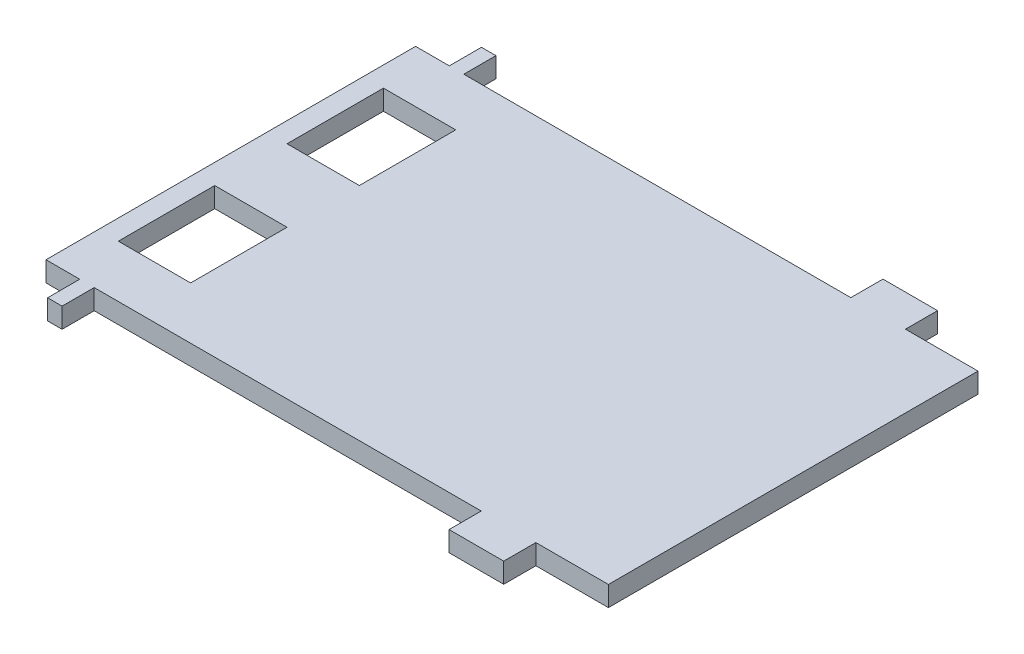
ISO-10303-21;
HEADER;
FILE_DESCRIPTION(('STEP AP214'),'2;1');
FILE_NAME('part.step','',(''),(''),'','','');
FILE_SCHEMA(('AUTOMOTIVE_DESIGN { 1 0 10303 214 1 1 1 1 }'));
ENDSEC;
DATA;
#1=APPLICATION_CONTEXT('core data for automotive mechanical design processes');
#2=APPLICATION_PROTOCOL_DEFINITION('international standard','automotive_design',2000,#1);
#3=PRODUCT_CONTEXT('',#1,'mechanical');
#4=PRODUCT('Part','Part','',(#3));
#5=PRODUCT_RELATED_PRODUCT_CATEGORY('part','',(#4));
#6=PRODUCT_DEFINITION_FORMATION('','',#4);
#7=PRODUCT_DEFINITION_CONTEXT('part definition',#1,'design');
#8=PRODUCT_DEFINITION('design','',#6,#7);
#9=PRODUCT_DEFINITION_SHAPE('','',#8);
#10=(LENGTH_UNIT() NAMED_UNIT(*) SI_UNIT(.MILLI.,.METRE.));
#11=(NAMED_UNIT(*) PLANE_ANGLE_UNIT() SI_UNIT($,.RADIAN.));
#12=(NAMED_UNIT(*) SI_UNIT($,.STERADIAN.) SOLID_ANGLE_UNIT());
#13=UNCERTAINTY_MEASURE_WITH_UNIT(LENGTH_MEASURE(1.E-05),#10,'distance_accuracy_value','');
#14=(GEOMETRIC_REPRESENTATION_CONTEXT(3) GLOBAL_UNCERTAINTY_ASSIGNED_CONTEXT((#13)) GLOBAL_UNIT_ASSIGNED_CONTEXT((#10,
#11,#12)) REPRESENTATION_CONTEXT('',''));
#15=CARTESIAN_POINT('',(0.,0.,0.));
#16=DIRECTION('',(0.,0.,1.));
#17=DIRECTION('',(1.,0.,0.));
#18=AXIS2_PLACEMENT_3D('',#15,#16,#17);
#19=CARTESIAN_POINT('',(-35.,2.5,27.));
#20=DIRECTION('',(0.,0.,-1.));
#21=DIRECTION('',(-1.,0.,0.));
#22=AXIS2_PLACEMENT_3D('',#19,#20,#21);
#23=PLANE('',#22);
#24=DIRECTION('',(1.,0.,0.));
#25=VECTOR('',#24,1.);
#26=CARTESIAN_POINT('',(-35.,0.,27.));
#27=LINE('',#26,#25);
#28=CARTESIAN_POINT('',(-30.8,0.,27.));
#29=VERTEX_POINT('',#28);
#30=CARTESIAN_POINT('',(-29.,0.,27.));
#31=VERTEX_POINT('',#30);
#32=EDGE_CURVE('E37',#29,#31,#27,.T.);
#33=ORIENTED_EDGE('',*,*,#32,.T.);
#34=DIRECTION('',(0.,1.,0.));
#35=VECTOR('',#34,1.);
#36=CARTESIAN_POINT('',(-29.,0.,27.));
#37=LINE('',#36,#35);
#38=CARTESIAN_POINT('',(-29.,2.5,27.));
#39=VERTEX_POINT('',#38);
#40=EDGE_CURVE('E306',#31,#39,#37,.T.);
#41=ORIENTED_EDGE('',*,*,#40,.T.);
#42=DIRECTION('',(1.,0.,0.));
#43=VECTOR('',#42,1.);
#44=CARTESIAN_POINT('',(-35.,2.5,27.));
#45=LINE('',#44,#43);
#46=CARTESIAN_POINT('',(-30.8,2.5,27.));
#47=VERTEX_POINT('',#46);
#48=EDGE_CURVE('E11',#47,#39,#45,.T.);
#49=ORIENTED_EDGE('',*,*,#48,.F.);
#50=DIRECTION('',(0.,1.,0.));
#51=VECTOR('',#50,1.);
#52=CARTESIAN_POINT('',(-30.8,0.,27.));
#53=LINE('',#52,#51);
#54=EDGE_CURVE('E348',#29,#47,#53,.T.);
#55=ORIENTED_EDGE('',*,*,#54,.F.);
#56=EDGE_LOOP('',(#33,#41,#49,#55));
#57=FACE_BOUND('',#56,.T.);
#58=ADVANCED_FACE('F33',(#57),#23,.F.);
#59=CARTESIAN_POINT('',(-35.,2.5,-27.));
#60=DIRECTION('',(0.,0.,1.));
#61=DIRECTION('',(1.,0.,0.));
#62=AXIS2_PLACEMENT_3D('',#59,#60,#61);
#63=PLANE('',#62);
#64=DIRECTION('',(-1.,0.,0.));
#65=VECTOR('',#64,1.);
#66=CARTESIAN_POINT('',(-35.,0.,-27.));
#67=LINE('',#66,#65);
#68=CARTESIAN_POINT('',(25.97,0.,-27.));
#69=VERTEX_POINT('',#68);
#70=CARTESIAN_POINT('',(19.17,0.,-27.));
#71=VERTEX_POINT('',#70);
#72=EDGE_CURVE('E426',#69,#71,#67,.T.);
#73=ORIENTED_EDGE('',*,*,#72,.T.);
#74=DIRECTION('',(0.,1.,0.));
#75=VECTOR('',#74,1.);
#76=CARTESIAN_POINT('',(19.17,0.,-27.));
#77=LINE('',#76,#75);
#78=CARTESIAN_POINT('',(19.17,2.5,-27.));
#79=VERTEX_POINT('',#78);
#80=EDGE_CURVE('E387',#71,#79,#77,.T.);
#81=ORIENTED_EDGE('',*,*,#80,.T.);
#82=DIRECTION('',(-1.,0.,0.));
#83=VECTOR('',#82,1.);
#84=CARTESIAN_POINT('',(-35.,2.5,-27.));
#85=LINE('',#84,#83);
#86=CARTESIAN_POINT('',(25.97,2.5,-27.));
#87=VERTEX_POINT('',#86);
#88=EDGE_CURVE('E418',#87,#79,#85,.T.);
#89=ORIENTED_EDGE('',*,*,#88,.F.);
#90=DIRECTION('',(0.,1.,0.));
#91=VECTOR('',#90,1.);
#92=CARTESIAN_POINT('',(25.97,0.,-27.));
#93=LINE('',#92,#91);
#94=EDGE_CURVE('E403',#69,#87,#93,.T.);
#95=ORIENTED_EDGE('',*,*,#94,.F.);
#96=EDGE_LOOP('',(#73,#81,#89,#95));
#97=FACE_BOUND('',#96,.T.);
#98=ADVANCED_FACE('F489',(#97),#63,.F.);
#99=CARTESIAN_POINT('',(35.,2.5,-27.));
#100=DIRECTION('',(-1.,0.,0.));
#101=DIRECTION('',(0.,0.,1.));
#102=AXIS2_PLACEMENT_3D('',#99,#100,#101);
#103=PLANE('',#102);
#104=DIRECTION('',(0.,0.,-1.));
#105=VECTOR('',#104,1.);
#106=CARTESIAN_POINT('',(35.,2.5,-27.));
#107=LINE('',#106,#105);
#108=CARTESIAN_POINT('',(35.,2.5,23.));
#109=VERTEX_POINT('',#108);
#110=CARTESIAN_POINT('',(35.,2.5,-23.));
#111=VERTEX_POINT('',#110);
#112=EDGE_CURVE('E415',#109,#111,#107,.T.);
#113=ORIENTED_EDGE('',*,*,#112,.F.);
#114=DIRECTION('',(0.,1.,0.));
#115=VECTOR('',#114,1.);
#116=CARTESIAN_POINT('',(35.,0.,23.));
#117=LINE('',#116,#115);
#118=CARTESIAN_POINT('',(35.,0.,23.));
#119=VERTEX_POINT('',#118);
#120=EDGE_CURVE('E330',#119,#109,#117,.T.);
#121=ORIENTED_EDGE('',*,*,#120,.F.);
#122=DIRECTION('',(0.,0.,-1.));
#123=VECTOR('',#122,1.);
#124=CARTESIAN_POINT('',(35.,0.,-27.));
#125=LINE('',#124,#123);
#126=CARTESIAN_POINT('',(35.,0.,-23.));
#127=VERTEX_POINT('',#126);
#128=EDGE_CURVE('E411',#119,#127,#125,.T.);
#129=ORIENTED_EDGE('',*,*,#128,.T.);
#130=DIRECTION('',(0.,1.,0.));
#131=VECTOR('',#130,1.);
#132=CARTESIAN_POINT('',(35.,0.,-23.));
#133=LINE('',#132,#131);
#134=EDGE_CURVE('E408',#127,#111,#133,.T.);
#135=ORIENTED_EDGE('',*,*,#134,.T.);
#136=EDGE_LOOP('',(#113,#121,#129,#135));
#137=FACE_BOUND('',#136,.T.);
#138=ADVANCED_FACE('F35',(#137),#103,.F.);
#139=CARTESIAN_POINT('',(-29.,0.,-27.));
#140=VERTEX_POINT('',#139);
#141=CARTESIAN_POINT('',(-30.8,0.,-27.));
#142=VERTEX_POINT('',#141);
#143=EDGE_CURVE('E425',#140,#142,#67,.T.);
#144=ORIENTED_EDGE('',*,*,#143,.T.);
#145=DIRECTION('',(0.,1.,0.));
#146=VECTOR('',#145,1.);
#147=CARTESIAN_POINT('',(-30.8,0.,-27.));
#148=LINE('',#147,#146);
#149=CARTESIAN_POINT('',(-30.8,2.5,-27.));
#150=VERTEX_POINT('',#149);
#151=EDGE_CURVE('E363',#142,#150,#148,.T.);
#152=ORIENTED_EDGE('',*,*,#151,.T.);
#153=CARTESIAN_POINT('',(-29.,2.5,-27.));
#154=VERTEX_POINT('',#153);
#155=EDGE_CURVE('E417',#154,#150,#85,.T.);
#156=ORIENTED_EDGE('',*,*,#155,.F.);
#157=DIRECTION('',(0.,1.,0.));
#158=VECTOR('',#157,1.);
#159=CARTESIAN_POINT('',(-29.,0.,-27.));
#160=LINE('',#159,#158);
#161=EDGE_CURVE('E380',#140,#154,#160,.T.);
#162=ORIENTED_EDGE('',*,*,#161,.F.);
#163=EDGE_LOOP('',(#144,#152,#156,#162));
#164=FACE_BOUND('',#163,.T.);
#165=ADVANCED_FACE('F474',(#164),#63,.F.);
#166=CARTESIAN_POINT('',(-35.,2.5,-27.));
#167=DIRECTION('',(1.,0.,0.));
#168=DIRECTION('',(0.,0.,-1.));
#169=AXIS2_PLACEMENT_3D('',#166,#167,#168);
#170=PLANE('',#169);
#171=DIRECTION('',(0.,0.,1.));
#172=VECTOR('',#171,1.);
#173=CARTESIAN_POINT('',(-35.,0.,-27.));
#174=LINE('',#173,#172);
#175=CARTESIAN_POINT('',(-35.,0.,-23.));
#176=VERTEX_POINT('',#175);
#177=CARTESIAN_POINT('',(-35.,0.,23.));
#178=VERTEX_POINT('',#177);
#179=EDGE_CURVE('E428',#176,#178,#174,.T.);
#180=ORIENTED_EDGE('',*,*,#179,.T.);
#181=DIRECTION('',(0.,1.,0.));
#182=VECTOR('',#181,1.);
#183=CARTESIAN_POINT('',(-35.,0.,23.));
#184=LINE('',#183,#182);
#185=CARTESIAN_POINT('',(-35.,2.5,23.));
#186=VERTEX_POINT('',#185);
#187=EDGE_CURVE('E341',#178,#186,#184,.T.);
#188=ORIENTED_EDGE('',*,*,#187,.T.);
#189=DIRECTION('',(0.,0.,1.));
#190=VECTOR('',#189,1.);
#191=CARTESIAN_POINT('',(-35.,2.5,-27.));
#192=LINE('',#191,#190);
#193=CARTESIAN_POINT('',(-35.,2.5,-23.));
#194=VERTEX_POINT('',#193);
#195=EDGE_CURVE('E421',#194,#186,#192,.T.);
#196=ORIENTED_EDGE('',*,*,#195,.F.);
#197=DIRECTION('',(0.,1.,0.));
#198=VECTOR('',#197,1.);
#199=CARTESIAN_POINT('',(-35.,0.,-23.));
#200=LINE('',#199,#198);
#201=EDGE_CURVE('E359',#176,#194,#200,.T.);
#202=ORIENTED_EDGE('',*,*,#201,.F.);
#203=EDGE_LOOP('',(#180,#188,#196,#202));
#204=FACE_BOUND('',#203,.T.);
#205=ADVANCED_FACE('F466',(#204),#170,.F.);
#206=CARTESIAN_POINT('',(19.17,2.5,27.));
#207=VERTEX_POINT('',#206);
#208=CARTESIAN_POINT('',(25.97,2.5,27.));
#209=VERTEX_POINT('',#208);
#210=EDGE_CURVE('E42',#207,#209,#45,.T.);
#211=ORIENTED_EDGE('',*,*,#210,.F.);
#212=DIRECTION('',(0.,1.,0.));
#213=VECTOR('',#212,1.);
#214=CARTESIAN_POINT('',(19.17,0.,27.));
#215=LINE('',#214,#213);
#216=CARTESIAN_POINT('',(19.17,0.,27.));
#217=VERTEX_POINT('',#216);
#218=EDGE_CURVE('E299',#217,#207,#215,.T.);
#219=ORIENTED_EDGE('',*,*,#218,.F.);
#220=CARTESIAN_POINT('',(25.97,0.,27.));
#221=VERTEX_POINT('',#220);
#222=EDGE_CURVE('E430',#217,#221,#27,.T.);
#223=ORIENTED_EDGE('',*,*,#222,.T.);
#224=DIRECTION('',(0.,1.,0.));
#225=VECTOR('',#224,1.);
#226=CARTESIAN_POINT('',(25.97,0.,27.));
#227=LINE('',#226,#225);
#228=EDGE_CURVE('E322',#221,#209,#227,.T.);
#229=ORIENTED_EDGE('',*,*,#228,.T.);
#230=EDGE_LOOP('',(#211,#219,#223,#229));
#231=FACE_BOUND('',#230,.T.);
#232=ADVANCED_FACE('F511',(#231),#23,.F.);
#233=CARTESIAN_POINT('',(0.,2.5,0.));
#234=DIRECTION('',(0.,1.,0.));
#235=DIRECTION('',(0.,0.,1.));
#236=AXIS2_PLACEMENT_3D('',#233,#234,#235);
#237=PLANE('',#236);
#238=DIRECTION('',(1.,0.,0.));
#239=VECTOR('',#238,1.);
#240=CARTESIAN_POINT('',(-32.5,2.5,16.5));
#241=LINE('',#240,#239);
#242=CARTESIAN_POINT('',(-32.5,2.5,16.5));
#243=VERTEX_POINT('',#242);
#244=CARTESIAN_POINT('',(-23.5,2.5,16.5));
#245=VERTEX_POINT('',#244);
#246=EDGE_CURVE('E50',#243,#245,#241,.T.);
#247=ORIENTED_EDGE('',*,*,#246,.F.);
#248=DIRECTION('',(0.,0.,1.));
#249=VECTOR('',#248,1.);
#250=CARTESIAN_POINT('',(-32.5,2.5,16.5));
#251=LINE('',#250,#249);
#252=CARTESIAN_POINT('',(-32.5,2.5,4.49999999999999));
#253=VERTEX_POINT('',#252);
#254=EDGE_CURVE('E238',#253,#243,#251,.T.);
#255=ORIENTED_EDGE('',*,*,#254,.F.);
#256=DIRECTION('',(-1.,0.,0.));
#257=VECTOR('',#256,1.);
#258=CARTESIAN_POINT('',(-32.5,2.5,4.49999999999999));
#259=LINE('',#258,#257);
#260=CARTESIAN_POINT('',(-23.5,2.5,4.49999999999999));
#261=VERTEX_POINT('',#260);
#262=EDGE_CURVE('E241',#261,#253,#259,.T.);
#263=ORIENTED_EDGE('',*,*,#262,.F.);
#264=DIRECTION('',(0.,0.,-1.));
#265=VECTOR('',#264,1.);
#266=CARTESIAN_POINT('',(-23.5,2.5,16.5));
#267=LINE('',#266,#265);
#268=EDGE_CURVE('E247',#245,#261,#267,.T.);
#269=ORIENTED_EDGE('',*,*,#268,.F.);
#270=EDGE_LOOP('',(#247,#255,#263,#269));
#271=FACE_BOUND('',#270,.T.);
#272=DIRECTION('',(0.,0.,-1.));
#273=VECTOR('',#272,1.);
#274=CARTESIAN_POINT('',(-23.5,2.5,-16.5));
#275=LINE('',#274,#273);
#276=CARTESIAN_POINT('',(-23.5,2.5,-4.49999999999999));
#277=VERTEX_POINT('',#276);
#278=CARTESIAN_POINT('',(-23.5,2.5,-16.5));
#279=VERTEX_POINT('',#278);
#280=EDGE_CURVE('E253',#277,#279,#275,.T.);
#281=ORIENTED_EDGE('',*,*,#280,.F.);
#282=DIRECTION('',(1.,0.,0.));
#283=VECTOR('',#282,1.);
#284=CARTESIAN_POINT('',(-32.5,2.5,-4.49999999999999));
#285=LINE('',#284,#283);
#286=CARTESIAN_POINT('',(-32.5,2.5,-4.49999999999999));
#287=VERTEX_POINT('',#286);
#288=EDGE_CURVE('E261',#287,#277,#285,.T.);
#289=ORIENTED_EDGE('',*,*,#288,.F.);
#290=DIRECTION('',(0.,0.,1.));
#291=VECTOR('',#290,1.);
#292=CARTESIAN_POINT('',(-32.5,2.5,-16.5));
#293=LINE('',#292,#291);
#294=CARTESIAN_POINT('',(-32.5,2.5,-16.5));
#295=VERTEX_POINT('',#294);
#296=EDGE_CURVE('E275',#295,#287,#293,.T.);
#297=ORIENTED_EDGE('',*,*,#296,.F.);
#298=DIRECTION('',(-1.,0.,0.));
#299=VECTOR('',#298,1.);
#300=CARTESIAN_POINT('',(-32.5,2.5,-16.5));
#301=LINE('',#300,#299);
#302=EDGE_CURVE('E272',#279,#295,#301,.T.);
#303=ORIENTED_EDGE('',*,*,#302,.F.);
#304=EDGE_LOOP('',(#281,#289,#297,#303));
#305=FACE_BOUND('',#304,.T.);
#306=DIRECTION('',(0.,0.,1.));
#307=VECTOR('',#306,1.);
#308=CARTESIAN_POINT('',(-29.,2.5,23.));
#309=LINE('',#308,#307);
#310=CARTESIAN_POINT('',(-29.,2.5,23.));
#311=VERTEX_POINT('',#310);
#312=EDGE_CURVE('E293',#311,#39,#309,.T.);
#313=ORIENTED_EDGE('',*,*,#312,.F.);
#314=DIRECTION('',(-1.,0.,0.));
#315=VECTOR('',#314,1.);
#316=CARTESIAN_POINT('',(19.17,2.5,23.));
#317=LINE('',#316,#315);
#318=CARTESIAN_POINT('',(19.17,2.5,23.));
#319=VERTEX_POINT('',#318);
#320=EDGE_CURVE('E302',#319,#311,#317,.T.);
#321=ORIENTED_EDGE('',*,*,#320,.F.);
#322=DIRECTION('',(0.,0.,-1.));
#323=VECTOR('',#322,1.);
#324=CARTESIAN_POINT('',(19.17,2.5,27.));
#325=LINE('',#324,#323);
#326=EDGE_CURVE('E282',#207,#319,#325,.T.);
#327=ORIENTED_EDGE('',*,*,#326,.F.);
#328=ORIENTED_EDGE('',*,*,#210,.T.);
#329=DIRECTION('',(0.,0.,1.));
#330=VECTOR('',#329,1.);
#331=CARTESIAN_POINT('',(25.97,2.5,27.));
#332=LINE('',#331,#330);
#333=CARTESIAN_POINT('',(25.97,2.5,23.));
#334=VERTEX_POINT('',#333);
#335=EDGE_CURVE('E309',#334,#209,#332,.T.);
#336=ORIENTED_EDGE('',*,*,#335,.F.);
#337=DIRECTION('',(-1.,0.,0.));
#338=VECTOR('',#337,1.);
#339=CARTESIAN_POINT('',(25.97,2.5,23.));
#340=LINE('',#339,#338);
#341=EDGE_CURVE('E319',#109,#334,#340,.T.);
#342=ORIENTED_EDGE('',*,*,#341,.F.);
#343=ORIENTED_EDGE('',*,*,#112,.T.);
#344=DIRECTION('',(1.,0.,0.));
#345=VECTOR('',#344,1.);
#346=CARTESIAN_POINT('',(25.97,2.5,-23.));
#347=LINE('',#346,#345);
#348=CARTESIAN_POINT('',(25.97,2.5,-23.));
#349=VERTEX_POINT('',#348);
#350=EDGE_CURVE('E400',#349,#111,#347,.T.);
#351=ORIENTED_EDGE('',*,*,#350,.F.);
#352=DIRECTION('',(0.,0.,1.));
#353=VECTOR('',#352,1.);
#354=CARTESIAN_POINT('',(25.97,2.5,-27.));
#355=LINE('',#354,#353);
#356=EDGE_CURVE('E390',#87,#349,#355,.T.);
#357=ORIENTED_EDGE('',*,*,#356,.F.);
#358=ORIENTED_EDGE('',*,*,#88,.T.);
#359=DIRECTION('',(0.,0.,-1.));
#360=VECTOR('',#359,1.);
#361=CARTESIAN_POINT('',(19.17,2.5,-27.));
#362=LINE('',#361,#360);
#363=CARTESIAN_POINT('',(19.17,2.5,-23.));
#364=VERTEX_POINT('',#363);
#365=EDGE_CURVE('E374',#364,#79,#362,.T.);
#366=ORIENTED_EDGE('',*,*,#365,.F.);
#367=DIRECTION('',(1.,0.,0.));
#368=VECTOR('',#367,1.);
#369=CARTESIAN_POINT('',(19.17,2.5,-23.));
#370=LINE('',#369,#368);
#371=CARTESIAN_POINT('',(-29.,2.5,-23.));
#372=VERTEX_POINT('',#371);
#373=EDGE_CURVE('E383',#372,#364,#370,.T.);
#374=ORIENTED_EDGE('',*,*,#373,.F.);
#375=DIRECTION('',(0.,0.,1.));
#376=VECTOR('',#375,1.);
#377=CARTESIAN_POINT('',(-29.,2.5,-23.));
#378=LINE('',#377,#376);
#379=EDGE_CURVE('E366',#154,#372,#378,.T.);
#380=ORIENTED_EDGE('',*,*,#379,.F.);
#381=ORIENTED_EDGE('',*,*,#155,.T.);
#382=DIRECTION('',(0.,0.,-1.));
#383=VECTOR('',#382,1.);
#384=CARTESIAN_POINT('',(-30.8,2.5,-27.));
#385=LINE('',#384,#383);
#386=CARTESIAN_POINT('',(-30.8,2.5,-23.));
#387=VERTEX_POINT('',#386);
#388=EDGE_CURVE('E356',#387,#150,#385,.T.);
#389=ORIENTED_EDGE('',*,*,#388,.F.);
#390=DIRECTION('',(1.,0.,0.));
#391=VECTOR('',#390,1.);
#392=CARTESIAN_POINT('',(-30.8,2.5,-23.));
#393=LINE('',#392,#391);
#394=EDGE_CURVE('E347',#194,#387,#393,.T.);
#395=ORIENTED_EDGE('',*,*,#394,.F.);
#396=ORIENTED_EDGE('',*,*,#195,.T.);
#397=DIRECTION('',(-1.,0.,0.));
#398=VECTOR('',#397,1.);
#399=CARTESIAN_POINT('',(-30.8,2.5,23.));
#400=LINE('',#399,#398);
#401=CARTESIAN_POINT('',(-30.8,2.5,23.));
#402=VERTEX_POINT('',#401);
#403=EDGE_CURVE('E329',#402,#186,#400,.T.);
#404=ORIENTED_EDGE('',*,*,#403,.F.);
#405=DIRECTION('',(0.,0.,-1.));
#406=VECTOR('',#405,1.);
#407=CARTESIAN_POINT('',(-30.8,2.5,27.));
#408=LINE('',#407,#406);
#409=EDGE_CURVE('E338',#47,#402,#408,.T.);
#410=ORIENTED_EDGE('',*,*,#409,.F.);
#411=ORIENTED_EDGE('',*,*,#48,.T.);
#412=EDGE_LOOP('',(#313,#321,#327,#328,#336,#342,#343,#351,#357,#358,#366,#374,#380,#381,#389,
#395,#396,#404,#410,#411));
#413=FACE_BOUND('',#412,.T.);
#414=ADVANCED_FACE('F450',(#271,#305,#413),#237,.T.);
#415=CARTESIAN_POINT('',(0.,0.,0.));
#416=DIRECTION('',(0.,1.,0.));
#417=DIRECTION('',(0.,0.,1.));
#418=AXIS2_PLACEMENT_3D('',#415,#416,#417);
#419=PLANE('',#418);
#420=DIRECTION('',(0.,0.,1.));
#421=VECTOR('',#420,1.);
#422=CARTESIAN_POINT('',(-32.5,0.,16.5));
#423=LINE('',#422,#421);
#424=CARTESIAN_POINT('',(-32.5,0.,4.49999999999999));
#425=VERTEX_POINT('',#424);
#426=CARTESIAN_POINT('',(-32.5,0.,16.5));
#427=VERTEX_POINT('',#426);
#428=EDGE_CURVE('E228',#425,#427,#423,.T.);
#429=ORIENTED_EDGE('',*,*,#428,.T.);
#430=DIRECTION('',(1.,0.,0.));
#431=VECTOR('',#430,1.);
#432=CARTESIAN_POINT('',(-32.5,0.,16.5));
#433=LINE('',#432,#431);
#434=CARTESIAN_POINT('',(-23.5,0.,16.5));
#435=VERTEX_POINT('',#434);
#436=EDGE_CURVE('E222',#427,#435,#433,.T.);
#437=ORIENTED_EDGE('',*,*,#436,.T.);
#438=DIRECTION('',(0.,0.,-1.));
#439=VECTOR('',#438,1.);
#440=CARTESIAN_POINT('',(-23.5,0.,16.5));
#441=LINE('',#440,#439);
#442=CARTESIAN_POINT('',(-23.5,0.,4.49999999999999));
#443=VERTEX_POINT('',#442);
#444=EDGE_CURVE('E231',#435,#443,#441,.T.);
#445=ORIENTED_EDGE('',*,*,#444,.T.);
#446=DIRECTION('',(-1.,0.,0.));
#447=VECTOR('',#446,1.);
#448=CARTESIAN_POINT('',(-32.5,0.,4.49999999999999));
#449=LINE('',#448,#447);
#450=EDGE_CURVE('E58',#443,#425,#449,.T.);
#451=ORIENTED_EDGE('',*,*,#450,.T.);
#452=EDGE_LOOP('',(#429,#437,#445,#451));
#453=FACE_BOUND('',#452,.T.);
#454=DIRECTION('',(1.,0.,0.));
#455=VECTOR('',#454,1.);
#456=CARTESIAN_POINT('',(-32.5,0.,-4.49999999999999));
#457=LINE('',#456,#455);
#458=CARTESIAN_POINT('',(-32.5,0.,-4.49999999999999));
#459=VERTEX_POINT('',#458);
#460=CARTESIAN_POINT('',(-23.5,0.,-4.49999999999999));
#461=VERTEX_POINT('',#460);
#462=EDGE_CURVE('E267',#459,#461,#457,.T.);
#463=ORIENTED_EDGE('',*,*,#462,.T.);
#464=DIRECTION('',(0.,0.,-1.));
#465=VECTOR('',#464,1.);
#466=CARTESIAN_POINT('',(-23.5,0.,-16.5));
#467=LINE('',#466,#465);
#468=CARTESIAN_POINT('',(-23.5,0.,-16.5));
#469=VERTEX_POINT('',#468);
#470=EDGE_CURVE('E257',#461,#469,#467,.T.);
#471=ORIENTED_EDGE('',*,*,#470,.T.);
#472=DIRECTION('',(-1.,0.,0.));
#473=VECTOR('',#472,1.);
#474=CARTESIAN_POINT('',(-32.5,0.,-16.5));
#475=LINE('',#474,#473);
#476=CARTESIAN_POINT('',(-32.5,0.,-16.5));
#477=VERTEX_POINT('',#476);
#478=EDGE_CURVE('E260',#469,#477,#475,.T.);
#479=ORIENTED_EDGE('',*,*,#478,.T.);
#480=DIRECTION('',(0.,0.,1.));
#481=VECTOR('',#480,1.);
#482=CARTESIAN_POINT('',(-32.5,0.,-16.5));
#483=LINE('',#482,#481);
#484=EDGE_CURVE('E264',#477,#459,#483,.T.);
#485=ORIENTED_EDGE('',*,*,#484,.T.);
#486=EDGE_LOOP('',(#463,#471,#479,#485));
#487=FACE_BOUND('',#486,.T.);
#488=DIRECTION('',(-1.,0.,0.));
#489=VECTOR('',#488,1.);
#490=CARTESIAN_POINT('',(19.17,0.,23.));
#491=LINE('',#490,#489);
#492=CARTESIAN_POINT('',(19.17,0.,23.));
#493=VERTEX_POINT('',#492);
#494=CARTESIAN_POINT('',(-29.,0.,23.));
#495=VERTEX_POINT('',#494);
#496=EDGE_CURVE('E292',#493,#495,#491,.T.);
#497=ORIENTED_EDGE('',*,*,#496,.T.);
#498=DIRECTION('',(0.,0.,1.));
#499=VECTOR('',#498,1.);
#500=CARTESIAN_POINT('',(-29.,0.,23.));
#501=LINE('',#500,#499);
#502=EDGE_CURVE('E296',#495,#31,#501,.T.);
#503=ORIENTED_EDGE('',*,*,#502,.T.);
#504=ORIENTED_EDGE('',*,*,#32,.F.);
#505=DIRECTION('',(0.,0.,-1.));
#506=VECTOR('',#505,1.);
#507=CARTESIAN_POINT('',(-30.8,0.,27.));
#508=LINE('',#507,#506);
#509=CARTESIAN_POINT('',(-30.8,0.,23.));
#510=VERTEX_POINT('',#509);
#511=EDGE_CURVE('E337',#29,#510,#508,.T.);
#512=ORIENTED_EDGE('',*,*,#511,.T.);
#513=DIRECTION('',(-1.,0.,0.));
#514=VECTOR('',#513,1.);
#515=CARTESIAN_POINT('',(-30.8,0.,23.));
#516=LINE('',#515,#514);
#517=EDGE_CURVE('E334',#510,#178,#516,.T.);
#518=ORIENTED_EDGE('',*,*,#517,.T.);
#519=ORIENTED_EDGE('',*,*,#179,.F.);
#520=DIRECTION('',(1.,0.,0.));
#521=VECTOR('',#520,1.);
#522=CARTESIAN_POINT('',(-30.8,0.,-23.));
#523=LINE('',#522,#521);
#524=CARTESIAN_POINT('',(-30.8,0.,-23.));
#525=VERTEX_POINT('',#524);
#526=EDGE_CURVE('E352',#176,#525,#523,.T.);
#527=ORIENTED_EDGE('',*,*,#526,.T.);
#528=DIRECTION('',(0.,0.,-1.));
#529=VECTOR('',#528,1.);
#530=CARTESIAN_POINT('',(-30.8,0.,-27.));
#531=LINE('',#530,#529);
#532=EDGE_CURVE('E355',#525,#142,#531,.T.);
#533=ORIENTED_EDGE('',*,*,#532,.T.);
#534=ORIENTED_EDGE('',*,*,#143,.F.);
#535=DIRECTION('',(0.,0.,1.));
#536=VECTOR('',#535,1.);
#537=CARTESIAN_POINT('',(-29.,0.,-23.));
#538=LINE('',#537,#536);
#539=CARTESIAN_POINT('',(-29.,0.,-23.));
#540=VERTEX_POINT('',#539);
#541=EDGE_CURVE('E370',#140,#540,#538,.T.);
#542=ORIENTED_EDGE('',*,*,#541,.T.);
#543=DIRECTION('',(1.,0.,0.));
#544=VECTOR('',#543,1.);
#545=CARTESIAN_POINT('',(19.17,0.,-23.));
#546=LINE('',#545,#544);
#547=CARTESIAN_POINT('',(19.17,0.,-23.));
#548=VERTEX_POINT('',#547);
#549=EDGE_CURVE('E373',#540,#548,#546,.T.);
#550=ORIENTED_EDGE('',*,*,#549,.T.);
#551=DIRECTION('',(0.,0.,-1.));
#552=VECTOR('',#551,1.);
#553=CARTESIAN_POINT('',(19.17,0.,-27.));
#554=LINE('',#553,#552);
#555=EDGE_CURVE('E377',#548,#71,#554,.T.);
#556=ORIENTED_EDGE('',*,*,#555,.T.);
#557=ORIENTED_EDGE('',*,*,#72,.F.);
#558=DIRECTION('',(0.,0.,1.));
#559=VECTOR('',#558,1.);
#560=CARTESIAN_POINT('',(25.97,0.,-27.));
#561=LINE('',#560,#559);
#562=CARTESIAN_POINT('',(25.97,0.,-23.));
#563=VERTEX_POINT('',#562);
#564=EDGE_CURVE('E396',#69,#563,#561,.T.);
#565=ORIENTED_EDGE('',*,*,#564,.T.);
#566=DIRECTION('',(1.,0.,0.));
#567=VECTOR('',#566,1.);
#568=CARTESIAN_POINT('',(25.97,0.,-23.));
#569=LINE('',#568,#567);
#570=EDGE_CURVE('E399',#563,#127,#569,.T.);
#571=ORIENTED_EDGE('',*,*,#570,.T.);
#572=ORIENTED_EDGE('',*,*,#128,.F.);
#573=DIRECTION('',(-1.,0.,0.));
#574=VECTOR('',#573,1.);
#575=CARTESIAN_POINT('',(25.97,0.,23.));
#576=LINE('',#575,#574);
#577=CARTESIAN_POINT('',(25.97,0.,23.));
#578=VERTEX_POINT('',#577);
#579=EDGE_CURVE('E318',#119,#578,#576,.T.);
#580=ORIENTED_EDGE('',*,*,#579,.T.);
#581=DIRECTION('',(0.,0.,1.));
#582=VECTOR('',#581,1.);
#583=CARTESIAN_POINT('',(25.97,0.,27.));
#584=LINE('',#583,#582);
#585=EDGE_CURVE('E315',#578,#221,#584,.T.);
#586=ORIENTED_EDGE('',*,*,#585,.T.);
#587=ORIENTED_EDGE('',*,*,#222,.F.);
#588=DIRECTION('',(0.,0.,-1.));
#589=VECTOR('',#588,1.);
#590=CARTESIAN_POINT('',(19.17,0.,27.));
#591=LINE('',#590,#589);
#592=EDGE_CURVE('E289',#217,#493,#591,.T.);
#593=ORIENTED_EDGE('',*,*,#592,.T.);
#594=EDGE_LOOP('',(#497,#503,#504,#512,#518,#519,#527,#533,#534,#542,#550,#556,#557,#565,#571,
#572,#580,#586,#587,#593));
#595=FACE_BOUND('',#594,.T.);
#596=ADVANCED_FACE('F235',(#453,#487,#595),#419,.F.);
#597=CARTESIAN_POINT('',(25.97,0.,-23.));
#598=DIRECTION('',(0.,0.,1.));
#599=DIRECTION('',(1.,0.,0.));
#600=AXIS2_PLACEMENT_3D('',#597,#598,#599);
#601=PLANE('',#600);
#602=ORIENTED_EDGE('',*,*,#350,.T.);
#603=ORIENTED_EDGE('',*,*,#134,.F.);
#604=ORIENTED_EDGE('',*,*,#570,.F.);
#605=DIRECTION('',(0.,1.,0.));
#606=VECTOR('',#605,1.);
#607=CARTESIAN_POINT('',(25.97,0.,-23.));
#608=LINE('',#607,#606);
#609=EDGE_CURVE('E412',#563,#349,#608,.T.);
#610=ORIENTED_EDGE('',*,*,#609,.T.);
#611=EDGE_LOOP('',(#602,#603,#604,#610));
#612=FACE_BOUND('',#611,.T.);
#613=ADVANCED_FACE('F500',(#612),#601,.F.);
#614=CARTESIAN_POINT('',(25.97,0.,-27.));
#615=DIRECTION('',(-1.,0.,0.));
#616=DIRECTION('',(0.,0.,1.));
#617=AXIS2_PLACEMENT_3D('',#614,#615,#616);
#618=PLANE('',#617);
#619=ORIENTED_EDGE('',*,*,#356,.T.);
#620=ORIENTED_EDGE('',*,*,#609,.F.);
#621=ORIENTED_EDGE('',*,*,#564,.F.);
#622=ORIENTED_EDGE('',*,*,#94,.T.);
#623=EDGE_LOOP('',(#619,#620,#621,#622));
#624=FACE_BOUND('',#623,.T.);
#625=ADVANCED_FACE('F493',(#624),#618,.F.);
#626=CARTESIAN_POINT('',(19.17,0.,-27.));
#627=DIRECTION('',(1.,0.,0.));
#628=DIRECTION('',(0.,0.,-1.));
#629=AXIS2_PLACEMENT_3D('',#626,#627,#628);
#630=PLANE('',#629);
#631=ORIENTED_EDGE('',*,*,#365,.T.);
#632=ORIENTED_EDGE('',*,*,#80,.F.);
#633=ORIENTED_EDGE('',*,*,#555,.F.);
#634=DIRECTION('',(0.,1.,0.));
#635=VECTOR('',#634,1.);
#636=CARTESIAN_POINT('',(19.17,0.,-23.));
#637=LINE('',#636,#635);
#638=EDGE_CURVE('E391',#548,#364,#637,.T.);
#639=ORIENTED_EDGE('',*,*,#638,.T.);
#640=EDGE_LOOP('',(#631,#632,#633,#639));
#641=FACE_BOUND('',#640,.T.);
#642=ADVANCED_FACE('F485',(#641),#630,.F.);
#643=CARTESIAN_POINT('',(19.17,0.,-23.));
#644=DIRECTION('',(0.,0.,1.));
#645=DIRECTION('',(1.,0.,0.));
#646=AXIS2_PLACEMENT_3D('',#643,#644,#645);
#647=PLANE('',#646);
#648=ORIENTED_EDGE('',*,*,#373,.T.);
#649=ORIENTED_EDGE('',*,*,#638,.F.);
#650=ORIENTED_EDGE('',*,*,#549,.F.);
#651=DIRECTION('',(0.,1.,0.));
#652=VECTOR('',#651,1.);
#653=CARTESIAN_POINT('',(-29.,0.,-23.));
#654=LINE('',#653,#652);
#655=EDGE_CURVE('E393',#540,#372,#654,.T.);
#656=ORIENTED_EDGE('',*,*,#655,.T.);
#657=EDGE_LOOP('',(#648,#649,#650,#656));
#658=FACE_BOUND('',#657,.T.);
#659=ADVANCED_FACE('F481',(#658),#647,.F.);
#660=CARTESIAN_POINT('',(-29.,0.,-23.));
#661=DIRECTION('',(-1.,0.,0.));
#662=DIRECTION('',(0.,0.,1.));
#663=AXIS2_PLACEMENT_3D('',#660,#661,#662);
#664=PLANE('',#663);
#665=ORIENTED_EDGE('',*,*,#379,.T.);
#666=ORIENTED_EDGE('',*,*,#655,.F.);
#667=ORIENTED_EDGE('',*,*,#541,.F.);
#668=ORIENTED_EDGE('',*,*,#161,.T.);
#669=EDGE_LOOP('',(#665,#666,#667,#668));
#670=FACE_BOUND('',#669,.T.);
#671=ADVANCED_FACE('F478',(#670),#664,.F.);
#672=CARTESIAN_POINT('',(-30.8,0.,-27.));
#673=DIRECTION('',(1.,0.,0.));
#674=DIRECTION('',(0.,0.,-1.));
#675=AXIS2_PLACEMENT_3D('',#672,#673,#674);
#676=PLANE('',#675);
#677=ORIENTED_EDGE('',*,*,#388,.T.);
#678=ORIENTED_EDGE('',*,*,#151,.F.);
#679=ORIENTED_EDGE('',*,*,#532,.F.);
#680=DIRECTION('',(0.,1.,0.));
#681=VECTOR('',#680,1.);
#682=CARTESIAN_POINT('',(-30.8,0.,-23.));
#683=LINE('',#682,#681);
#684=EDGE_CURVE('E367',#525,#387,#683,.T.);
#685=ORIENTED_EDGE('',*,*,#684,.T.);
#686=EDGE_LOOP('',(#677,#678,#679,#685));
#687=FACE_BOUND('',#686,.T.);
#688=ADVANCED_FACE('F472',(#687),#676,.F.);
#689=CARTESIAN_POINT('',(-30.8,0.,-23.));
#690=DIRECTION('',(0.,0.,1.));
#691=DIRECTION('',(1.,0.,0.));
#692=AXIS2_PLACEMENT_3D('',#689,#690,#691);
#693=PLANE('',#692);
#694=ORIENTED_EDGE('',*,*,#394,.T.);
#695=ORIENTED_EDGE('',*,*,#684,.F.);
#696=ORIENTED_EDGE('',*,*,#526,.F.);
#697=ORIENTED_EDGE('',*,*,#201,.T.);
#698=EDGE_LOOP('',(#694,#695,#696,#697));
#699=FACE_BOUND('',#698,.T.);
#700=ADVANCED_FACE('F463',(#699),#693,.F.);
#701=CARTESIAN_POINT('',(-30.8,0.,23.));
#702=DIRECTION('',(0.,0.,-1.));
#703=DIRECTION('',(-1.,0.,0.));
#704=AXIS2_PLACEMENT_3D('',#701,#702,#703);
#705=PLANE('',#704);
#706=ORIENTED_EDGE('',*,*,#403,.T.);
#707=ORIENTED_EDGE('',*,*,#187,.F.);
#708=ORIENTED_EDGE('',*,*,#517,.F.);
#709=DIRECTION('',(0.,1.,0.));
#710=VECTOR('',#709,1.);
#711=CARTESIAN_POINT('',(-30.8,0.,23.));
#712=LINE('',#711,#710);
#713=EDGE_CURVE('E345',#510,#402,#712,.T.);
#714=ORIENTED_EDGE('',*,*,#713,.T.);
#715=EDGE_LOOP('',(#706,#707,#708,#714));
#716=FACE_BOUND('',#715,.T.);
#717=ADVANCED_FACE('F458',(#716),#705,.F.);
#718=CARTESIAN_POINT('',(-30.8,0.,27.));
#719=DIRECTION('',(1.,0.,0.));
#720=DIRECTION('',(0.,0.,-1.));
#721=AXIS2_PLACEMENT_3D('',#718,#719,#720);
#722=PLANE('',#721);
#723=ORIENTED_EDGE('',*,*,#409,.T.);
#724=ORIENTED_EDGE('',*,*,#713,.F.);
#725=ORIENTED_EDGE('',*,*,#511,.F.);
#726=ORIENTED_EDGE('',*,*,#54,.T.);
#727=EDGE_LOOP('',(#723,#724,#725,#726));
#728=FACE_BOUND('',#727,.T.);
#729=ADVANCED_FACE('F456',(#728),#722,.F.);
#730=CARTESIAN_POINT('',(25.97,0.,27.));
#731=DIRECTION('',(-1.,0.,0.));
#732=DIRECTION('',(0.,0.,1.));
#733=AXIS2_PLACEMENT_3D('',#730,#731,#732);
#734=PLANE('',#733);
#735=ORIENTED_EDGE('',*,*,#335,.T.);
#736=ORIENTED_EDGE('',*,*,#228,.F.);
#737=ORIENTED_EDGE('',*,*,#585,.F.);
#738=DIRECTION('',(0.,1.,0.));
#739=VECTOR('',#738,1.);
#740=CARTESIAN_POINT('',(25.97,0.,23.));
#741=LINE('',#740,#739);
#742=EDGE_CURVE('E327',#578,#334,#741,.T.);
#743=ORIENTED_EDGE('',*,*,#742,.T.);
#744=EDGE_LOOP('',(#735,#736,#737,#743));
#745=FACE_BOUND('',#744,.T.);
#746=ADVANCED_FACE('F509',(#745),#734,.F.);
#747=CARTESIAN_POINT('',(25.97,0.,23.));
#748=DIRECTION('',(0.,0.,-1.));
#749=DIRECTION('',(-1.,0.,0.));
#750=AXIS2_PLACEMENT_3D('',#747,#748,#749);
#751=PLANE('',#750);
#752=ORIENTED_EDGE('',*,*,#341,.T.);
#753=ORIENTED_EDGE('',*,*,#742,.F.);
#754=ORIENTED_EDGE('',*,*,#579,.F.);
#755=ORIENTED_EDGE('',*,*,#120,.T.);
#756=EDGE_LOOP('',(#752,#753,#754,#755));
#757=FACE_BOUND('',#756,.T.);
#758=ADVANCED_FACE('F506',(#757),#751,.F.);
#759=CARTESIAN_POINT('',(-29.,0.,23.));
#760=DIRECTION('',(-1.,0.,0.));
#761=DIRECTION('',(0.,0.,1.));
#762=AXIS2_PLACEMENT_3D('',#759,#760,#761);
#763=PLANE('',#762);
#764=ORIENTED_EDGE('',*,*,#312,.T.);
#765=ORIENTED_EDGE('',*,*,#40,.F.);
#766=ORIENTED_EDGE('',*,*,#502,.F.);
#767=DIRECTION('',(0.,1.,0.));
#768=VECTOR('',#767,1.);
#769=CARTESIAN_POINT('',(-29.,0.,23.));
#770=LINE('',#769,#768);
#771=EDGE_CURVE('E310',#495,#311,#770,.T.);
#772=ORIENTED_EDGE('',*,*,#771,.T.);
#773=EDGE_LOOP('',(#764,#765,#766,#772));
#774=FACE_BOUND('',#773,.T.);
#775=ADVANCED_FACE('F446',(#774),#763,.F.);
#776=CARTESIAN_POINT('',(19.17,0.,23.));
#777=DIRECTION('',(0.,0.,-1.));
#778=DIRECTION('',(-1.,0.,0.));
#779=AXIS2_PLACEMENT_3D('',#776,#777,#778);
#780=PLANE('',#779);
#781=ORIENTED_EDGE('',*,*,#320,.T.);
#782=ORIENTED_EDGE('',*,*,#771,.F.);
#783=ORIENTED_EDGE('',*,*,#496,.F.);
#784=DIRECTION('',(0.,1.,0.));
#785=VECTOR('',#784,1.);
#786=CARTESIAN_POINT('',(19.17,0.,23.));
#787=LINE('',#786,#785);
#788=EDGE_CURVE('E312',#493,#319,#787,.T.);
#789=ORIENTED_EDGE('',*,*,#788,.T.);
#790=EDGE_LOOP('',(#781,#782,#783,#789));
#791=FACE_BOUND('',#790,.T.);
#792=ADVANCED_FACE('F516',(#791),#780,.F.);
#793=CARTESIAN_POINT('',(19.17,0.,27.));
#794=DIRECTION('',(1.,0.,0.));
#795=DIRECTION('',(0.,0.,-1.));
#796=AXIS2_PLACEMENT_3D('',#793,#794,#795);
#797=PLANE('',#796);
#798=ORIENTED_EDGE('',*,*,#326,.T.);
#799=ORIENTED_EDGE('',*,*,#788,.F.);
#800=ORIENTED_EDGE('',*,*,#592,.F.);
#801=ORIENTED_EDGE('',*,*,#218,.T.);
#802=EDGE_LOOP('',(#798,#799,#800,#801));
#803=FACE_BOUND('',#802,.T.);
#804=ADVANCED_FACE('F514',(#803),#797,.F.);
#805=CARTESIAN_POINT('',(-23.5,0.,-16.5));
#806=DIRECTION('',(1.,0.,0.));
#807=DIRECTION('',(0.,0.,-1.));
#808=AXIS2_PLACEMENT_3D('',#805,#806,#807);
#809=PLANE('',#808);
#810=ORIENTED_EDGE('',*,*,#280,.T.);
#811=DIRECTION('',(0.,1.,0.));
#812=VECTOR('',#811,1.);
#813=CARTESIAN_POINT('',(-23.5,0.,-16.5));
#814=LINE('',#813,#812);
#815=EDGE_CURVE('E270',#469,#279,#814,.T.);
#816=ORIENTED_EDGE('',*,*,#815,.F.);
#817=ORIENTED_EDGE('',*,*,#470,.F.);
#818=DIRECTION('',(0.,1.,0.));
#819=VECTOR('',#818,1.);
#820=CARTESIAN_POINT('',(-23.5,0.,-4.49999999999999));
#821=LINE('',#820,#819);
#822=EDGE_CURVE('E280',#461,#277,#821,.T.);
#823=ORIENTED_EDGE('',*,*,#822,.T.);
#824=EDGE_LOOP('',(#810,#816,#817,#823));
#825=FACE_BOUND('',#824,.T.);
#826=ADVANCED_FACE('F523',(#825),#809,.F.);
#827=CARTESIAN_POINT('',(-32.5,0.,-4.49999999999999));
#828=DIRECTION('',(0.,0.,1.));
#829=DIRECTION('',(1.,0.,0.));
#830=AXIS2_PLACEMENT_3D('',#827,#828,#829);
#831=PLANE('',#830);
#832=ORIENTED_EDGE('',*,*,#288,.T.);
#833=ORIENTED_EDGE('',*,*,#822,.F.);
#834=ORIENTED_EDGE('',*,*,#462,.F.);
#835=DIRECTION('',(0.,1.,0.));
#836=VECTOR('',#835,1.);
#837=CARTESIAN_POINT('',(-32.5,0.,-4.49999999999999));
#838=LINE('',#837,#836);
#839=EDGE_CURVE('E283',#459,#287,#838,.T.);
#840=ORIENTED_EDGE('',*,*,#839,.T.);
#841=EDGE_LOOP('',(#832,#833,#834,#840));
#842=FACE_BOUND('',#841,.T.);
#843=ADVANCED_FACE('F659',(#842),#831,.F.);
#844=CARTESIAN_POINT('',(-32.5,0.,-16.5));
#845=DIRECTION('',(-1.,0.,0.));
#846=DIRECTION('',(0.,0.,1.));
#847=AXIS2_PLACEMENT_3D('',#844,#845,#846);
#848=PLANE('',#847);
#849=ORIENTED_EDGE('',*,*,#296,.T.);
#850=ORIENTED_EDGE('',*,*,#839,.F.);
#851=ORIENTED_EDGE('',*,*,#484,.F.);
#852=DIRECTION('',(0.,1.,0.));
#853=VECTOR('',#852,1.);
#854=CARTESIAN_POINT('',(-32.5,0.,-16.5));
#855=LINE('',#854,#853);
#856=EDGE_CURVE('E285',#477,#295,#855,.T.);
#857=ORIENTED_EDGE('',*,*,#856,.T.);
#858=EDGE_LOOP('',(#849,#850,#851,#857));
#859=FACE_BOUND('',#858,.T.);
#860=ADVANCED_FACE('F669',(#859),#848,.F.);
#861=CARTESIAN_POINT('',(-32.5,0.,-16.5));
#862=DIRECTION('',(0.,0.,-1.));
#863=DIRECTION('',(-1.,0.,0.));
#864=AXIS2_PLACEMENT_3D('',#861,#862,#863);
#865=PLANE('',#864);
#866=ORIENTED_EDGE('',*,*,#302,.T.);
#867=ORIENTED_EDGE('',*,*,#856,.F.);
#868=ORIENTED_EDGE('',*,*,#478,.F.);
#869=ORIENTED_EDGE('',*,*,#815,.T.);
#870=EDGE_LOOP('',(#866,#867,#868,#869));
#871=FACE_BOUND('',#870,.T.);
#872=ADVANCED_FACE('F678',(#871),#865,.F.);
#873=CARTESIAN_POINT('',(-32.5,0.,16.5));
#874=DIRECTION('',(0.,0.,1.));
#875=DIRECTION('',(1.,0.,0.));
#876=AXIS2_PLACEMENT_3D('',#873,#874,#875);
#877=PLANE('',#876);
#878=ORIENTED_EDGE('',*,*,#246,.T.);
#879=DIRECTION('',(0.,1.,0.));
#880=VECTOR('',#879,1.);
#881=CARTESIAN_POINT('',(-23.5,0.,16.5));
#882=LINE('',#881,#880);
#883=EDGE_CURVE('E218',#435,#245,#882,.T.);
#884=ORIENTED_EDGE('',*,*,#883,.F.);
#885=ORIENTED_EDGE('',*,*,#436,.F.);
#886=DIRECTION('',(0.,1.,0.));
#887=VECTOR('',#886,1.);
#888=CARTESIAN_POINT('',(-32.5,0.,16.5));
#889=LINE('',#888,#887);
#890=EDGE_CURVE('E251',#427,#243,#889,.T.);
#891=ORIENTED_EDGE('',*,*,#890,.T.);
#892=EDGE_LOOP('',(#878,#884,#885,#891));
#893=FACE_BOUND('',#892,.T.);
#894=ADVANCED_FACE('F220',(#893),#877,.F.);
#895=CARTESIAN_POINT('',(-32.5,0.,16.5));
#896=DIRECTION('',(-1.,0.,0.));
#897=DIRECTION('',(0.,0.,1.));
#898=AXIS2_PLACEMENT_3D('',#895,#896,#897);
#899=PLANE('',#898);
#900=ORIENTED_EDGE('',*,*,#254,.T.);
#901=ORIENTED_EDGE('',*,*,#890,.F.);
#902=ORIENTED_EDGE('',*,*,#428,.F.);
#903=DIRECTION('',(0.,1.,0.));
#904=VECTOR('',#903,1.);
#905=CARTESIAN_POINT('',(-32.5,0.,4.49999999999999));
#906=LINE('',#905,#904);
#907=EDGE_CURVE('E254',#425,#253,#906,.T.);
#908=ORIENTED_EDGE('',*,*,#907,.T.);
#909=EDGE_LOOP('',(#900,#901,#902,#908));
#910=FACE_BOUND('',#909,.T.);
#911=ADVANCED_FACE('F695',(#910),#899,.F.);
#912=CARTESIAN_POINT('',(-32.5,0.,4.49999999999999));
#913=DIRECTION('',(0.,0.,-1.));
#914=DIRECTION('',(-1.,0.,0.));
#915=AXIS2_PLACEMENT_3D('',#912,#913,#914);
#916=PLANE('',#915);
#917=ORIENTED_EDGE('',*,*,#262,.T.);
#918=ORIENTED_EDGE('',*,*,#907,.F.);
#919=ORIENTED_EDGE('',*,*,#450,.F.);
#920=DIRECTION('',(0.,1.,0.));
#921=VECTOR('',#920,1.);
#922=CARTESIAN_POINT('',(-23.5,0.,4.49999999999999));
#923=LINE('',#922,#921);
#924=EDGE_CURVE('E227',#443,#261,#923,.T.);
#925=ORIENTED_EDGE('',*,*,#924,.T.);
#926=EDGE_LOOP('',(#917,#918,#919,#925));
#927=FACE_BOUND('',#926,.T.);
#928=ADVANCED_FACE('F703',(#927),#916,.F.);
#929=CARTESIAN_POINT('',(-23.5,0.,16.5));
#930=DIRECTION('',(1.,0.,0.));
#931=DIRECTION('',(0.,0.,-1.));
#932=AXIS2_PLACEMENT_3D('',#929,#930,#931);
#933=PLANE('',#932);
#934=ORIENTED_EDGE('',*,*,#268,.T.);
#935=ORIENTED_EDGE('',*,*,#924,.F.);
#936=ORIENTED_EDGE('',*,*,#444,.F.);
#937=ORIENTED_EDGE('',*,*,#883,.T.);
#938=EDGE_LOOP('',(#934,#935,#936,#937));
#939=FACE_BOUND('',#938,.T.);
#940=ADVANCED_FACE('F232',(#939),#933,.F.);
#941=CLOSED_SHELL('',(#58,#98,#138,#165,#205,#232,#414,#596,#613,#625,#642,#659,#671,#688,#700,
#717,#729,#746,#758,#775,#792,#804,#826,#843,#860,#872,#894,#911,#928,#940));
#942=MANIFOLD_SOLID_BREP('B2',#941);
#943=ADVANCED_BREP_SHAPE_REPRESENTATION('',(#18,#942),#14);
#944=SHAPE_DEFINITION_REPRESENTATION(#9,#943);
ENDSEC;
END-ISO-10303-21;
